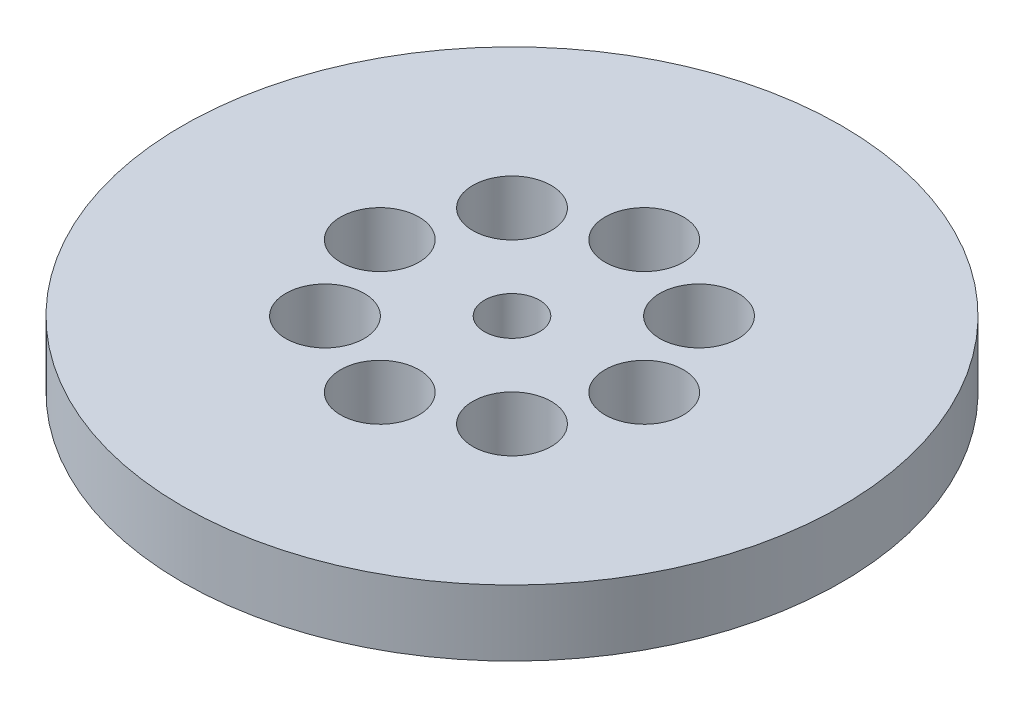
ISO-10303-21;
HEADER;
FILE_DESCRIPTION(('STEP AP214'),'2;1');
FILE_NAME('part.step','',(''),(''),'','','');
FILE_SCHEMA(('AUTOMOTIVE_DESIGN { 1 0 10303 214 1 1 1 1 }'));
ENDSEC;
DATA;
#1=APPLICATION_CONTEXT('core data for automotive mechanical design processes');
#2=APPLICATION_PROTOCOL_DEFINITION('international standard','automotive_design',2000,#1);
#3=PRODUCT_CONTEXT('',#1,'mechanical');
#4=PRODUCT('Part','Part','',(#3));
#5=PRODUCT_RELATED_PRODUCT_CATEGORY('part','',(#4));
#6=PRODUCT_DEFINITION_FORMATION('','',#4);
#7=PRODUCT_DEFINITION_CONTEXT('part definition',#1,'design');
#8=PRODUCT_DEFINITION('design','',#6,#7);
#9=PRODUCT_DEFINITION_SHAPE('','',#8);
#10=(LENGTH_UNIT() NAMED_UNIT(*) SI_UNIT(.MILLI.,.METRE.));
#11=(NAMED_UNIT(*) PLANE_ANGLE_UNIT() SI_UNIT($,.RADIAN.));
#12=(NAMED_UNIT(*) SI_UNIT($,.STERADIAN.) SOLID_ANGLE_UNIT());
#13=UNCERTAINTY_MEASURE_WITH_UNIT(LENGTH_MEASURE(1.E-05),#10,'distance_accuracy_value','');
#14=(GEOMETRIC_REPRESENTATION_CONTEXT(3) GLOBAL_UNCERTAINTY_ASSIGNED_CONTEXT((#13)) GLOBAL_UNIT_ASSIGNED_CONTEXT((#10,
#11,#12)) REPRESENTATION_CONTEXT('',''));
#15=CARTESIAN_POINT('',(0.,0.,0.));
#16=DIRECTION('',(0.,0.,1.));
#17=DIRECTION('',(1.,0.,0.));
#18=AXIS2_PLACEMENT_3D('',#15,#16,#17);
#19=CARTESIAN_POINT('',(0.,12.,0.));
#20=DIRECTION('',(0.,-1.,0.));
#21=DIRECTION('',(0.,0.,-1.));
#22=AXIS2_PLACEMENT_3D('',#19,#20,#21);
#23=CYLINDRICAL_SURFACE('',#22,60.);
#24=CARTESIAN_POINT('',(0.,12.,0.));
#25=DIRECTION('',(0.,1.,0.));
#26=DIRECTION('',(0.,0.,1.));
#27=AXIS2_PLACEMENT_3D('',#24,#25,#26);
#28=CIRCLE('',#27,60.);
#29=CARTESIAN_POINT('',(0.,12.,60.));
#30=VERTEX_POINT('',#29);
#31=EDGE_CURVE('E10',#30,#30,#28,.T.);
#32=ORIENTED_EDGE('',*,*,#31,.F.);
#33=EDGE_LOOP('',(#32));
#34=FACE_BOUND('',#33,.T.);
#35=CARTESIAN_POINT('',(0.,0.,0.));
#36=DIRECTION('',(0.,1.,0.));
#37=DIRECTION('',(0.,0.,1.));
#38=AXIS2_PLACEMENT_3D('',#35,#36,#37);
#39=CIRCLE('',#38,60.);
#40=CARTESIAN_POINT('',(0.,0.,60.));
#41=VERTEX_POINT('',#40);
#42=EDGE_CURVE('E37',#41,#41,#39,.T.);
#43=ORIENTED_EDGE('',*,*,#42,.T.);
#44=EDGE_LOOP('',(#43));
#45=FACE_BOUND('',#44,.T.);
#46=ADVANCED_FACE('F40',(#34,#45),#23,.T.);
#47=CARTESIAN_POINT('',(0.,12.,0.));
#48=DIRECTION('',(0.,1.,0.));
#49=DIRECTION('',(0.,0.,1.));
#50=AXIS2_PLACEMENT_3D('',#47,#48,#49);
#51=PLANE('',#50);
#52=CARTESIAN_POINT('',(0.,12.,24.0759124960446));
#53=DIRECTION('',(0.,1.,0.));
#54=DIRECTION('',(1.,0.,0.));
#55=AXIS2_PLACEMENT_3D('',#52,#53,#54);
#56=CIRCLE('',#55,7.13810690485261);
#57=CARTESIAN_POINT('',(7.1381069048527,12.,24.0759124960446));
#58=VERTEX_POINT('',#57);
#59=EDGE_CURVE('E88',#58,#58,#56,.T.);
#60=ORIENTED_EDGE('',*,*,#59,.F.);
#61=EDGE_LOOP('',(#60));
#62=FACE_BOUND('',#61,.T.);
#63=CARTESIAN_POINT('',(17.0242409892072,12.,17.024240989207));
#64=DIRECTION('',(0.,1.,0.));
#65=DIRECTION('',(0.707106781186544,0.,-0.707106781186551));
#66=AXIS2_PLACEMENT_3D('',#63,#64,#65);
#67=CIRCLE('',#66,7.13810690485261);
#68=CARTESIAN_POINT('',(22.0716447864629,12.,11.9768371919512));
#69=VERTEX_POINT('',#68);
#70=EDGE_CURVE('E79',#69,#69,#67,.T.);
#71=ORIENTED_EDGE('',*,*,#70,.F.);
#72=EDGE_LOOP('',(#71));
#73=FACE_BOUND('',#72,.T.);
#74=CARTESIAN_POINT('',(24.0759124960446,12.,0.));
#75=DIRECTION('',(0.,1.,0.));
#76=DIRECTION('',(0.,0.,-1.));
#77=AXIS2_PLACEMENT_3D('',#74,#75,#76);
#78=CIRCLE('',#77,7.13810690485261);
#79=CARTESIAN_POINT('',(24.0759124960446,12.,-7.13810690485261));
#80=VERTEX_POINT('',#79);
#81=EDGE_CURVE('E74',#80,#80,#78,.T.);
#82=ORIENTED_EDGE('',*,*,#81,.F.);
#83=EDGE_LOOP('',(#82));
#84=FACE_BOUND('',#83,.T.);
#85=CARTESIAN_POINT('',(17.0242409892069,12.,-17.0242409892072));
#86=DIRECTION('',(0.,1.,0.));
#87=DIRECTION('',(-0.707106781186554,0.,-0.707106781186541));
#88=AXIS2_PLACEMENT_3D('',#85,#86,#87);
#89=CIRCLE('',#88,7.13810690485261);
#90=CARTESIAN_POINT('',(11.9768371919511,12.,-22.071644786463));
#91=VERTEX_POINT('',#90);
#92=EDGE_CURVE('E70',#91,#91,#89,.T.);
#93=ORIENTED_EDGE('',*,*,#92,.F.);
#94=EDGE_LOOP('',(#93));
#95=FACE_BOUND('',#94,.T.);
#96=CARTESIAN_POINT('',(-2.5218179758668E-13,12.,-24.0759124960446));
#97=DIRECTION('',(0.,1.,0.));
#98=DIRECTION('',(-1.,0.,0.));
#99=AXIS2_PLACEMENT_3D('',#96,#97,#98);
#100=CIRCLE('',#99,7.13810690485261);
#101=CARTESIAN_POINT('',(-7.13810690485286,12.,-24.0759124960445));
#102=VERTEX_POINT('',#101);
#103=EDGE_CURVE('E100',#102,#102,#100,.T.);
#104=ORIENTED_EDGE('',*,*,#103,.F.);
#105=EDGE_LOOP('',(#104));
#106=FACE_BOUND('',#105,.T.);
#107=CARTESIAN_POINT('',(-17.0242409892073,12.,-17.0242409892069));
#108=DIRECTION('',(0.,1.,0.));
#109=DIRECTION('',(-0.707106781186539,0.,0.707106781186556));
#110=AXIS2_PLACEMENT_3D('',#107,#108,#109);
#111=CIRCLE('',#110,7.13810690485261);
#112=CARTESIAN_POINT('',(-22.071644786463,12.,-11.976837191951));
#113=VERTEX_POINT('',#112);
#114=EDGE_CURVE('E93',#113,#113,#111,.T.);
#115=ORIENTED_EDGE('',*,*,#114,.F.);
#116=EDGE_LOOP('',(#115));
#117=FACE_BOUND('',#116,.T.);
#118=CARTESIAN_POINT('',(-17.024240989207,12.,17.0242409892071));
#119=DIRECTION('',(0.,1.,0.));
#120=DIRECTION('',(0.707106781186549,0.,0.707106781186546));
#121=AXIS2_PLACEMENT_3D('',#118,#119,#120);
#122=CIRCLE('',#121,7.13810690485261);
#123=CARTESIAN_POINT('',(-11.9768371919512,12.,22.0716447864629));
#124=VERTEX_POINT('',#123);
#125=EDGE_CURVE('E61',#124,#124,#122,.T.);
#126=ORIENTED_EDGE('',*,*,#125,.F.);
#127=EDGE_LOOP('',(#126));
#128=FACE_BOUND('',#127,.T.);
#129=CARTESIAN_POINT('',(-24.0759124960446,12.,0.));
#130=DIRECTION('',(0.,1.,0.));
#131=DIRECTION('',(0.,0.,1.));
#132=AXIS2_PLACEMENT_3D('',#129,#130,#131);
#133=CIRCLE('',#132,7.13810690485261);
#134=CARTESIAN_POINT('',(-24.0759124960446,12.,7.13810690485261));
#135=VERTEX_POINT('',#134);
#136=EDGE_CURVE('E54',#135,#135,#133,.T.);
#137=ORIENTED_EDGE('',*,*,#136,.F.);
#138=EDGE_LOOP('',(#137));
#139=FACE_BOUND('',#138,.T.);
#140=CARTESIAN_POINT('',(0.,12.,0.));
#141=DIRECTION('',(0.,1.,0.));
#142=DIRECTION('',(0.,0.,1.));
#143=AXIS2_PLACEMENT_3D('',#140,#141,#142);
#144=CIRCLE('',#143,5.);
#145=CARTESIAN_POINT('',(0.,12.,5.));
#146=VERTEX_POINT('',#145);
#147=EDGE_CURVE('E50',#146,#146,#144,.T.);
#148=ORIENTED_EDGE('',*,*,#147,.F.);
#149=EDGE_LOOP('',(#148));
#150=FACE_BOUND('',#149,.T.);
#151=ORIENTED_EDGE('',*,*,#31,.T.);
#152=EDGE_LOOP('',(#151));
#153=FACE_BOUND('',#152,.T.);
#154=ADVANCED_FACE('F115',(#62,#73,#84,#95,#106,#117,#128,#139,#150,#153),#51,.T.);
#155=CARTESIAN_POINT('',(0.,0.,0.));
#156=DIRECTION('',(0.,1.,0.));
#157=DIRECTION('',(0.,0.,1.));
#158=AXIS2_PLACEMENT_3D('',#155,#156,#157);
#159=PLANE('',#158);
#160=CARTESIAN_POINT('',(0.,0.,0.));
#161=DIRECTION('',(0.,1.,0.));
#162=DIRECTION('',(0.,0.,1.));
#163=AXIS2_PLACEMENT_3D('',#160,#161,#162);
#164=CIRCLE('',#163,5.);
#165=CARTESIAN_POINT('',(0.,0.,5.));
#166=VERTEX_POINT('',#165);
#167=EDGE_CURVE('E47',#166,#166,#164,.T.);
#168=ORIENTED_EDGE('',*,*,#167,.T.);
#169=EDGE_LOOP('',(#168));
#170=FACE_BOUND('',#169,.T.);
#171=ORIENTED_EDGE('',*,*,#42,.F.);
#172=EDGE_LOOP('',(#171));
#173=FACE_BOUND('',#172,.T.);
#174=ADVANCED_FACE('F113',(#170,#173),#159,.F.);
#175=CARTESIAN_POINT('',(0.,12.,0.));
#176=DIRECTION('',(0.,-1.,0.));
#177=DIRECTION('',(0.,0.,-1.));
#178=AXIS2_PLACEMENT_3D('',#175,#176,#177);
#179=CYLINDRICAL_SURFACE('',#178,5.);
#180=ORIENTED_EDGE('',*,*,#147,.T.);
#181=EDGE_LOOP('',(#180));
#182=FACE_BOUND('',#181,.T.);
#183=ORIENTED_EDGE('',*,*,#167,.F.);
#184=EDGE_LOOP('',(#183));
#185=FACE_BOUND('',#184,.T.);
#186=ADVANCED_FACE('F127',(#182,#185),#179,.F.);
#187=CARTESIAN_POINT('',(-24.0759124960446,1.21858607514635,0.));
#188=DIRECTION('',(0.,1.,0.));
#189=DIRECTION('',(0.,0.,1.));
#190=AXIS2_PLACEMENT_3D('',#187,#188,#189);
#191=CYLINDRICAL_SURFACE('',#190,7.13810690485261);
#192=CARTESIAN_POINT('',(-24.0759124960446,1.21858607514635,0.));
#193=DIRECTION('',(0.,1.,0.));
#194=DIRECTION('',(0.,0.,1.));
#195=AXIS2_PLACEMENT_3D('',#192,#193,#194);
#196=CIRCLE('',#195,7.13810690485261);
#197=CARTESIAN_POINT('',(-24.0759124960446,1.21858607514635,7.13810690485261));
#198=VERTEX_POINT('',#197);
#199=EDGE_CURVE('E55',#198,#198,#196,.T.);
#200=ORIENTED_EDGE('',*,*,#199,.F.);
#201=EDGE_LOOP('',(#200));
#202=FACE_BOUND('',#201,.T.);
#203=ORIENTED_EDGE('',*,*,#136,.T.);
#204=EDGE_LOOP('',(#203));
#205=FACE_BOUND('',#204,.T.);
#206=ADVANCED_FACE('F129',(#202,#205),#191,.F.);
#207=CARTESIAN_POINT('',(-24.0759124960446,1.21858607514635,0.));
#208=DIRECTION('',(0.,1.,0.));
#209=DIRECTION('',(0.,0.,1.));
#210=AXIS2_PLACEMENT_3D('',#207,#208,#209);
#211=PLANE('',#210);
#212=ORIENTED_EDGE('',*,*,#199,.T.);
#213=EDGE_LOOP('',(#212));
#214=FACE_BOUND('',#213,.T.);
#215=ADVANCED_FACE('F157',(#214),#211,.T.);
#216=CARTESIAN_POINT('',(-17.024240989207,1.21858607514635,17.0242409892071));
#217=DIRECTION('',(0.,1.,0.));
#218=DIRECTION('',(0.,0.,1.));
#219=AXIS2_PLACEMENT_3D('',#216,#217,#218);
#220=CYLINDRICAL_SURFACE('',#219,7.13810690485261);
#221=CARTESIAN_POINT('',(-17.024240989207,1.21858607514635,17.0242409892071));
#222=DIRECTION('',(0.,1.,0.));
#223=DIRECTION('',(0.707106781186549,0.,0.707106781186546));
#224=AXIS2_PLACEMENT_3D('',#221,#222,#223);
#225=CIRCLE('',#224,7.13810690485261);
#226=CARTESIAN_POINT('',(-11.9768371919512,1.21858607514635,22.0716447864629));
#227=VERTEX_POINT('',#226);
#228=EDGE_CURVE('E59',#227,#227,#225,.T.);
#229=ORIENTED_EDGE('',*,*,#228,.F.);
#230=EDGE_LOOP('',(#229));
#231=FACE_BOUND('',#230,.T.);
#232=ORIENTED_EDGE('',*,*,#125,.T.);
#233=EDGE_LOOP('',(#232));
#234=FACE_BOUND('',#233,.T.);
#235=ADVANCED_FACE('F170',(#231,#234),#220,.F.);
#236=CARTESIAN_POINT('',(-17.024240989207,1.21858607514635,17.0242409892071));
#237=DIRECTION('',(0.,1.,0.));
#238=DIRECTION('',(0.707106781186549,0.,0.707106781186546));
#239=AXIS2_PLACEMENT_3D('',#236,#237,#238);
#240=PLANE('',#239);
#241=ORIENTED_EDGE('',*,*,#228,.T.);
#242=EDGE_LOOP('',(#241));
#243=FACE_BOUND('',#242,.T.);
#244=ADVANCED_FACE('F182',(#243),#240,.T.);
#245=CARTESIAN_POINT('',(-17.0242409892073,1.21858607514635,-17.0242409892069));
#246=DIRECTION('',(0.,1.,0.));
#247=DIRECTION('',(0.,0.,1.));
#248=AXIS2_PLACEMENT_3D('',#245,#246,#247);
#249=CYLINDRICAL_SURFACE('',#248,7.13810690485261);
#250=CARTESIAN_POINT('',(-17.0242409892073,1.21858607514635,-17.0242409892069));
#251=DIRECTION('',(0.,1.,0.));
#252=DIRECTION('',(-0.707106781186539,0.,0.707106781186556));
#253=AXIS2_PLACEMENT_3D('',#250,#251,#252);
#254=CIRCLE('',#253,7.13810690485261);
#255=CARTESIAN_POINT('',(-22.071644786463,1.21858607514635,-11.976837191951));
#256=VERTEX_POINT('',#255);
#257=EDGE_CURVE('E94',#256,#256,#254,.T.);
#258=ORIENTED_EDGE('',*,*,#257,.F.);
#259=EDGE_LOOP('',(#258));
#260=FACE_BOUND('',#259,.T.);
#261=ORIENTED_EDGE('',*,*,#114,.T.);
#262=EDGE_LOOP('',(#261));
#263=FACE_BOUND('',#262,.T.);
#264=ADVANCED_FACE('F189',(#260,#263),#249,.F.);
#265=CARTESIAN_POINT('',(-17.0242409892073,1.21858607514635,-17.0242409892069));
#266=DIRECTION('',(0.,1.,0.));
#267=DIRECTION('',(-0.707106781186539,0.,0.707106781186556));
#268=AXIS2_PLACEMENT_3D('',#265,#266,#267);
#269=PLANE('',#268);
#270=ORIENTED_EDGE('',*,*,#257,.T.);
#271=EDGE_LOOP('',(#270));
#272=FACE_BOUND('',#271,.T.);
#273=ADVANCED_FACE('F107',(#272),#269,.T.);
#274=CARTESIAN_POINT('',(-2.5218179758668E-13,1.21858607514635,-24.0759124960446));
#275=DIRECTION('',(0.,1.,0.));
#276=DIRECTION('',(0.,0.,1.));
#277=AXIS2_PLACEMENT_3D('',#274,#275,#276);
#278=CYLINDRICAL_SURFACE('',#277,7.13810690485261);
#279=CARTESIAN_POINT('',(-2.5218179758668E-13,1.21858607514635,-24.0759124960446));
#280=DIRECTION('',(0.,1.,0.));
#281=DIRECTION('',(-1.,0.,0.));
#282=AXIS2_PLACEMENT_3D('',#279,#280,#281);
#283=CIRCLE('',#282,7.13810690485261);
#284=CARTESIAN_POINT('',(-7.13810690485286,1.21858607514635,-24.0759124960445));
#285=VERTEX_POINT('',#284);
#286=EDGE_CURVE('E72',#285,#285,#283,.T.);
#287=ORIENTED_EDGE('',*,*,#286,.F.);
#288=EDGE_LOOP('',(#287));
#289=FACE_BOUND('',#288,.T.);
#290=ORIENTED_EDGE('',*,*,#103,.T.);
#291=EDGE_LOOP('',(#290));
#292=FACE_BOUND('',#291,.T.);
#293=ADVANCED_FACE('F104',(#289,#292),#278,.F.);
#294=CARTESIAN_POINT('',(-2.5218179758668E-13,1.21858607514635,-24.0759124960446));
#295=DIRECTION('',(0.,1.,0.));
#296=DIRECTION('',(-1.,0.,0.));
#297=AXIS2_PLACEMENT_3D('',#294,#295,#296);
#298=PLANE('',#297);
#299=ORIENTED_EDGE('',*,*,#286,.T.);
#300=EDGE_LOOP('',(#299));
#301=FACE_BOUND('',#300,.T.);
#302=ADVANCED_FACE('F103',(#301),#298,.T.);
#303=CARTESIAN_POINT('',(17.0242409892069,1.21858607514635,-17.0242409892072));
#304=DIRECTION('',(0.,1.,0.));
#305=DIRECTION('',(0.,0.,1.));
#306=AXIS2_PLACEMENT_3D('',#303,#304,#305);
#307=CYLINDRICAL_SURFACE('',#306,7.13810690485261);
#308=CARTESIAN_POINT('',(17.0242409892069,1.21858607514635,-17.0242409892072));
#309=DIRECTION('',(0.,1.,0.));
#310=DIRECTION('',(-0.707106781186554,0.,-0.707106781186541));
#311=AXIS2_PLACEMENT_3D('',#308,#309,#310);
#312=CIRCLE('',#311,7.13810690485261);
#313=CARTESIAN_POINT('',(11.9768371919511,1.21858607514635,-22.071644786463));
#314=VERTEX_POINT('',#313);
#315=EDGE_CURVE('E69',#314,#314,#312,.T.);
#316=ORIENTED_EDGE('',*,*,#315,.F.);
#317=EDGE_LOOP('',(#316));
#318=FACE_BOUND('',#317,.T.);
#319=ORIENTED_EDGE('',*,*,#92,.T.);
#320=EDGE_LOOP('',(#319));
#321=FACE_BOUND('',#320,.T.);
#322=ADVANCED_FACE('F219',(#318,#321),#307,.F.);
#323=CARTESIAN_POINT('',(17.0242409892069,1.21858607514635,-17.0242409892072));
#324=DIRECTION('',(0.,1.,0.));
#325=DIRECTION('',(-0.707106781186554,0.,-0.707106781186541));
#326=AXIS2_PLACEMENT_3D('',#323,#324,#325);
#327=PLANE('',#326);
#328=ORIENTED_EDGE('',*,*,#315,.T.);
#329=EDGE_LOOP('',(#328));
#330=FACE_BOUND('',#329,.T.);
#331=ADVANCED_FACE('F227',(#330),#327,.T.);
#332=CARTESIAN_POINT('',(24.0759124960446,1.21858607514635,0.));
#333=DIRECTION('',(0.,1.,0.));
#334=DIRECTION('',(0.,0.,1.));
#335=AXIS2_PLACEMENT_3D('',#332,#333,#334);
#336=CYLINDRICAL_SURFACE('',#335,7.13810690485261);
#337=CARTESIAN_POINT('',(24.0759124960446,1.21858607514635,0.));
#338=DIRECTION('',(0.,1.,0.));
#339=DIRECTION('',(0.,0.,-1.));
#340=AXIS2_PLACEMENT_3D('',#337,#338,#339);
#341=CIRCLE('',#340,7.13810690485261);
#342=CARTESIAN_POINT('',(24.0759124960446,1.21858607514635,-7.13810690485261));
#343=VERTEX_POINT('',#342);
#344=EDGE_CURVE('E80',#343,#343,#341,.T.);
#345=ORIENTED_EDGE('',*,*,#344,.F.);
#346=EDGE_LOOP('',(#345));
#347=FACE_BOUND('',#346,.T.);
#348=ORIENTED_EDGE('',*,*,#81,.T.);
#349=EDGE_LOOP('',(#348));
#350=FACE_BOUND('',#349,.T.);
#351=ADVANCED_FACE('F240',(#347,#350),#336,.F.);
#352=CARTESIAN_POINT('',(24.0759124960446,1.21858607514635,0.));
#353=DIRECTION('',(0.,1.,0.));
#354=DIRECTION('',(0.,0.,-1.));
#355=AXIS2_PLACEMENT_3D('',#352,#353,#354);
#356=PLANE('',#355);
#357=ORIENTED_EDGE('',*,*,#344,.T.);
#358=EDGE_LOOP('',(#357));
#359=FACE_BOUND('',#358,.T.);
#360=ADVANCED_FACE('F246',(#359),#356,.T.);
#361=CARTESIAN_POINT('',(17.0242409892072,1.21858607514635,17.024240989207));
#362=DIRECTION('',(0.,1.,0.));
#363=DIRECTION('',(0.,0.,1.));
#364=AXIS2_PLACEMENT_3D('',#361,#362,#363);
#365=CYLINDRICAL_SURFACE('',#364,7.13810690485261);
#366=CARTESIAN_POINT('',(17.0242409892072,1.21858607514635,17.024240989207));
#367=DIRECTION('',(0.,1.,0.));
#368=DIRECTION('',(0.707106781186544,0.,-0.707106781186551));
#369=AXIS2_PLACEMENT_3D('',#366,#367,#368);
#370=CIRCLE('',#369,7.13810690485261);
#371=CARTESIAN_POINT('',(22.0716447864629,1.21858607514635,11.9768371919512));
#372=VERTEX_POINT('',#371);
#373=EDGE_CURVE('E82',#372,#372,#370,.T.);
#374=ORIENTED_EDGE('',*,*,#373,.F.);
#375=EDGE_LOOP('',(#374));
#376=FACE_BOUND('',#375,.T.);
#377=ORIENTED_EDGE('',*,*,#70,.T.);
#378=EDGE_LOOP('',(#377));
#379=FACE_BOUND('',#378,.T.);
#380=ADVANCED_FACE('F254',(#376,#379),#365,.F.);
#381=CARTESIAN_POINT('',(17.0242409892072,1.21858607514635,17.024240989207));
#382=DIRECTION('',(0.,1.,0.));
#383=DIRECTION('',(0.707106781186544,0.,-0.707106781186551));
#384=AXIS2_PLACEMENT_3D('',#381,#382,#383);
#385=PLANE('',#384);
#386=ORIENTED_EDGE('',*,*,#373,.T.);
#387=EDGE_LOOP('',(#386));
#388=FACE_BOUND('',#387,.T.);
#389=ADVANCED_FACE('F262',(#388),#385,.T.);
#390=CARTESIAN_POINT('',(0.,1.21858607514635,24.0759124960446));
#391=DIRECTION('',(0.,1.,0.));
#392=DIRECTION('',(0.,0.,1.));
#393=AXIS2_PLACEMENT_3D('',#390,#391,#392);
#394=CYLINDRICAL_SURFACE('',#393,7.13810690485261);
#395=CARTESIAN_POINT('',(0.,1.21858607514635,24.0759124960446));
#396=DIRECTION('',(0.,1.,0.));
#397=DIRECTION('',(1.,0.,0.));
#398=AXIS2_PLACEMENT_3D('',#395,#396,#397);
#399=CIRCLE('',#398,7.13810690485261);
#400=CARTESIAN_POINT('',(7.1381069048527,1.21858607514635,24.0759124960446));
#401=VERTEX_POINT('',#400);
#402=EDGE_CURVE('E63',#401,#401,#399,.T.);
#403=ORIENTED_EDGE('',*,*,#402,.F.);
#404=EDGE_LOOP('',(#403));
#405=FACE_BOUND('',#404,.T.);
#406=ORIENTED_EDGE('',*,*,#59,.T.);
#407=EDGE_LOOP('',(#406));
#408=FACE_BOUND('',#407,.T.);
#409=ADVANCED_FACE('F272',(#405,#408),#394,.F.);
#410=CARTESIAN_POINT('',(0.,1.21858607514635,24.0759124960446));
#411=DIRECTION('',(0.,1.,0.));
#412=DIRECTION('',(1.,0.,0.));
#413=AXIS2_PLACEMENT_3D('',#410,#411,#412);
#414=PLANE('',#413);
#415=ORIENTED_EDGE('',*,*,#402,.T.);
#416=EDGE_LOOP('',(#415));
#417=FACE_BOUND('',#416,.T.);
#418=ADVANCED_FACE('F285',(#417),#414,.T.);
#419=CLOSED_SHELL('',(#46,#154,#174,#186,#206,#215,#235,#244,#264,#273,#293,#302,#322,#331,#351,
#360,#380,#389,#409,#418));
#420=MANIFOLD_SOLID_BREP('B2',#419);
#421=ADVANCED_BREP_SHAPE_REPRESENTATION('',(#18,#420),#14);
#422=SHAPE_DEFINITION_REPRESENTATION(#9,#421);
ENDSEC;
END-ISO-10303-21;
